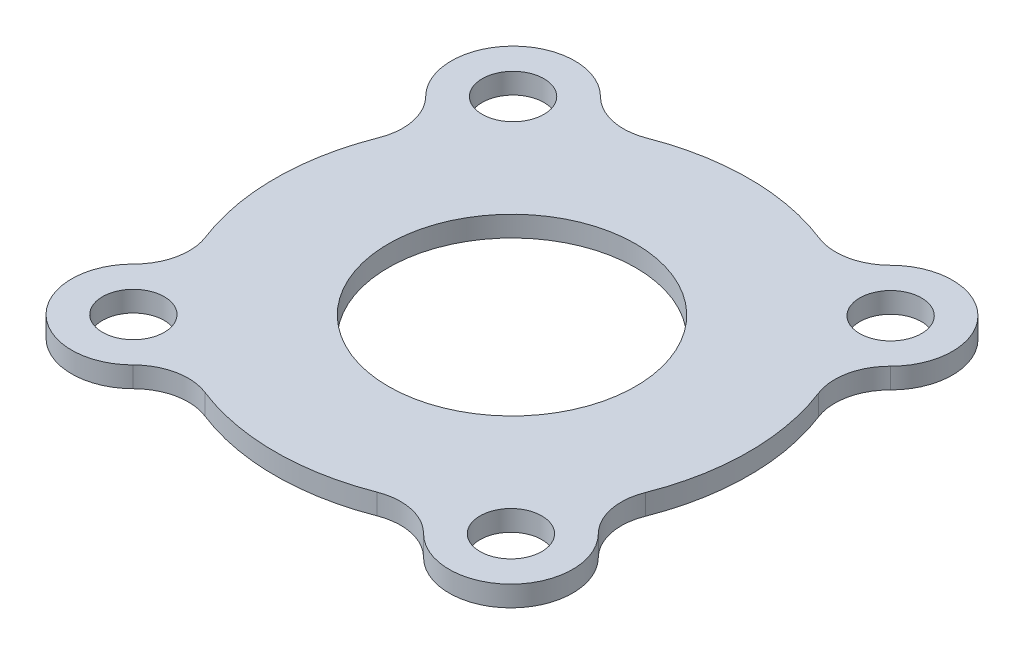
ISO-10303-21;
HEADER;
FILE_DESCRIPTION(('STEP AP214'),'2;1');
FILE_NAME('part.step','',(''),(''),'','','');
FILE_SCHEMA(('AUTOMOTIVE_DESIGN { 1 0 10303 214 1 1 1 1 }'));
ENDSEC;
DATA;
#1=APPLICATION_CONTEXT('core data for automotive mechanical design processes');
#2=APPLICATION_PROTOCOL_DEFINITION('international standard','automotive_design',2000,#1);
#3=PRODUCT_CONTEXT('',#1,'mechanical');
#4=PRODUCT('Part','Part','',(#3));
#5=PRODUCT_RELATED_PRODUCT_CATEGORY('part','',(#4));
#6=PRODUCT_DEFINITION_FORMATION('','',#4);
#7=PRODUCT_DEFINITION_CONTEXT('part definition',#1,'design');
#8=PRODUCT_DEFINITION('design','',#6,#7);
#9=PRODUCT_DEFINITION_SHAPE('','',#8);
#10=(LENGTH_UNIT() NAMED_UNIT(*) SI_UNIT(.MILLI.,.METRE.));
#11=(NAMED_UNIT(*) PLANE_ANGLE_UNIT() SI_UNIT($,.RADIAN.));
#12=(NAMED_UNIT(*) SI_UNIT($,.STERADIAN.) SOLID_ANGLE_UNIT());
#13=UNCERTAINTY_MEASURE_WITH_UNIT(LENGTH_MEASURE(1.E-05),#10,'distance_accuracy_value','');
#14=(GEOMETRIC_REPRESENTATION_CONTEXT(3) GLOBAL_UNCERTAINTY_ASSIGNED_CONTEXT((#13)) GLOBAL_UNIT_ASSIGNED_CONTEXT((#10,
#11,#12)) REPRESENTATION_CONTEXT('',''));
#15=CARTESIAN_POINT('',(0.,0.,0.));
#16=DIRECTION('',(0.,0.,1.));
#17=DIRECTION('',(1.,0.,0.));
#18=AXIS2_PLACEMENT_3D('',#15,#16,#17);
#19=CARTESIAN_POINT('',(0.,0.,0.));
#20=DIRECTION('',(0.,1.,0.));
#21=DIRECTION('',(0.,0.,1.));
#22=AXIS2_PLACEMENT_3D('',#19,#20,#21);
#23=PLANE('',#22);
#24=CARTESIAN_POINT('',(0.,0.,0.));
#25=DIRECTION('',(0.,1.,0.));
#26=DIRECTION('',(0.,0.,1.));
#27=AXIS2_PLACEMENT_3D('',#24,#25,#26);
#28=CIRCLE('',#27,6.00000000000002);
#29=CARTESIAN_POINT('',(0.,0.,6.00000000000002));
#30=VERTEX_POINT('',#29);
#31=EDGE_CURVE('E282',#30,#30,#28,.T.);
#32=ORIENTED_EDGE('',*,*,#31,.T.);
#33=EDGE_LOOP('',(#32));
#34=FACE_BOUND('',#33,.T.);
#35=CARTESIAN_POINT('',(0.,0.,0.));
#36=DIRECTION('',(0.,1.,0.));
#37=DIRECTION('',(0.,0.,1.));
#38=AXIS2_PLACEMENT_3D('',#35,#36,#37);
#39=CIRCLE('',#38,8.);
#40=CARTESIAN_POINT('',(0.,0.,8.));
#41=VERTEX_POINT('',#40);
#42=EDGE_CURVE('E11',#41,#41,#39,.T.);
#43=ORIENTED_EDGE('',*,*,#42,.F.);
#44=EDGE_LOOP('',(#43));
#45=FACE_BOUND('',#44,.T.);
#46=ADVANCED_FACE('F43',(#34,#45),#23,.F.);
#47=CARTESIAN_POINT('',(-9.21860010244733,1.,9.16610125141419));
#48=DIRECTION('',(0.,-1.,0.));
#49=DIRECTION('',(0.,0.,-1.));
#50=AXIS2_PLACEMENT_3D('',#47,#48,#49);
#51=CYLINDRICAL_SURFACE('',#50,2.99999999999999);
#52=CARTESIAN_POINT('',(-9.21860010244733,0.,9.16610125141419));
#53=DIRECTION('',(0.,1.,0.));
#54=DIRECTION('',(0.,0.,1.));
#55=AXIS2_PLACEMENT_3D('',#52,#53,#54);
#56=CIRCLE('',#55,2.99999999999999);
#57=CARTESIAN_POINT('',(-7.10334596750564,0.,11.2934705058243));
#58=VERTEX_POINT('',#57);
#59=CARTESIAN_POINT('',(-11.3338542373886,0.,7.03873199700244));
#60=VERTEX_POINT('',#59);
#61=EDGE_CURVE('E215',#58,#60,#56,.F.);
#62=ORIENTED_EDGE('',*,*,#61,.F.);
#63=DIRECTION('',(0.,-1.,0.));
#64=VECTOR('',#63,1.);
#65=CARTESIAN_POINT('',(-7.10334596750564,1.,11.2934705058243));
#66=LINE('',#65,#64);
#67=CARTESIAN_POINT('',(-7.10334596750564,1.,11.2934705058243));
#68=VERTEX_POINT('',#67);
#69=EDGE_CURVE('E53',#68,#58,#66,.T.);
#70=ORIENTED_EDGE('',*,*,#69,.F.);
#71=CARTESIAN_POINT('',(-9.21860010244733,1.,9.16610125141419));
#72=DIRECTION('',(0.,1.,0.));
#73=DIRECTION('',(0.,0.,1.));
#74=AXIS2_PLACEMENT_3D('',#71,#72,#73);
#75=CIRCLE('',#74,2.99999999999999);
#76=CARTESIAN_POINT('',(-11.3338542373886,1.,7.03873199700244));
#77=VERTEX_POINT('',#76);
#78=EDGE_CURVE('E286',#68,#77,#75,.F.);
#79=ORIENTED_EDGE('',*,*,#78,.T.);
#80=DIRECTION('',(0.,-1.,0.));
#81=VECTOR('',#80,1.);
#82=CARTESIAN_POINT('',(-11.3338542373886,1.,7.03873199700244));
#83=LINE('',#82,#81);
#84=EDGE_CURVE('E120',#77,#60,#83,.T.);
#85=ORIENTED_EDGE('',*,*,#84,.T.);
#86=EDGE_LOOP('',(#62,#70,#79,#85));
#87=FACE_BOUND('',#86,.T.);
#88=ADVANCED_FACE('F45',(#87),#51,.T.);
#89=CARTESIAN_POINT('',(-5.2058385817496,1.,13.2018458663984));
#90=DIRECTION('',(0.,-1.,0.));
#91=DIRECTION('',(0.,0.,-1.));
#92=AXIS2_PLACEMENT_3D('',#89,#90,#91);
#93=CYLINDRICAL_SURFACE('',#92,2.69117647058813);
#94=CARTESIAN_POINT('',(-5.2058385817496,0.,13.2018458663984));
#95=DIRECTION('',(0.,1.,0.));
#96=DIRECTION('',(0.,0.,1.));
#97=AXIS2_PLACEMENT_3D('',#94,#95,#96);
#98=CIRCLE('',#97,2.69117647058813);
#99=CARTESIAN_POINT('',(-4.21861737920023,0.,10.6982833860349));
#100=VERTEX_POINT('',#99);
#101=EDGE_CURVE('E219',#100,#58,#98,.T.);
#102=ORIENTED_EDGE('',*,*,#101,.F.);
#103=DIRECTION('',(0.,-1.,0.));
#104=VECTOR('',#103,1.);
#105=CARTESIAN_POINT('',(-4.21861737920023,1.,10.6982833860349));
#106=LINE('',#105,#104);
#107=CARTESIAN_POINT('',(-4.21861737920023,1.,10.6982833860349));
#108=VERTEX_POINT('',#107);
#109=EDGE_CURVE('E326',#108,#100,#106,.T.);
#110=ORIENTED_EDGE('',*,*,#109,.F.);
#111=CARTESIAN_POINT('',(-5.2058385817496,1.,13.2018458663984));
#112=DIRECTION('',(0.,1.,0.));
#113=DIRECTION('',(0.,0.,1.));
#114=AXIS2_PLACEMENT_3D('',#111,#112,#113);
#115=CIRCLE('',#114,2.69117647058813);
#116=EDGE_CURVE('E334',#108,#68,#115,.T.);
#117=ORIENTED_EDGE('',*,*,#116,.T.);
#118=ORIENTED_EDGE('',*,*,#69,.T.);
#119=EDGE_LOOP('',(#102,#110,#117,#118));
#120=FACE_BOUND('',#119,.T.);
#121=ADVANCED_FACE('F332',(#120),#93,.F.);
#122=CARTESIAN_POINT('',(0.,1.,0.));
#123=DIRECTION('',(0.,-1.,0.));
#124=DIRECTION('',(0.,0.,-1.));
#125=AXIS2_PLACEMENT_3D('',#122,#123,#124);
#126=CYLINDRICAL_SURFACE('',#125,11.5);
#127=CARTESIAN_POINT('',(0.,0.,0.));
#128=DIRECTION('',(0.,1.,0.));
#129=DIRECTION('',(0.,0.,1.));
#130=AXIS2_PLACEMENT_3D('',#127,#128,#129);
#131=CIRCLE('',#130,11.5);
#132=CARTESIAN_POINT('',(4.15744962661815,0.,10.7222018541964));
#133=VERTEX_POINT('',#132);
#134=EDGE_CURVE('E224',#100,#133,#131,.T.);
#135=ORIENTED_EDGE('',*,*,#134,.T.);
#136=DIRECTION('',(0.,-1.,0.));
#137=VECTOR('',#136,1.);
#138=CARTESIAN_POINT('',(4.15744962661815,1.,10.7222018541964));
#139=LINE('',#138,#137);
#140=CARTESIAN_POINT('',(4.15744962661815,1.,10.7222018541964));
#141=VERTEX_POINT('',#140);
#142=EDGE_CURVE('E322',#141,#133,#139,.T.);
#143=ORIENTED_EDGE('',*,*,#142,.F.);
#144=CARTESIAN_POINT('',(0.,1.,0.));
#145=DIRECTION('',(0.,1.,0.));
#146=DIRECTION('',(0.,0.,1.));
#147=AXIS2_PLACEMENT_3D('',#144,#145,#146);
#148=CIRCLE('',#147,11.5);
#149=EDGE_CURVE('E180',#108,#141,#148,.T.);
#150=ORIENTED_EDGE('',*,*,#149,.F.);
#151=ORIENTED_EDGE('',*,*,#109,.T.);
#152=EDGE_LOOP('',(#135,#143,#150,#151));
#153=FACE_BOUND('',#152,.T.);
#154=ADVANCED_FACE('F343',(#153),#126,.T.);
#155=CARTESIAN_POINT('',(5.13035663642772,1.,13.231361623145));
#156=DIRECTION('',(0.,-1.,0.));
#157=DIRECTION('',(0.,0.,-1.));
#158=AXIS2_PLACEMENT_3D('',#155,#156,#157);
#159=CYLINDRICAL_SURFACE('',#158,2.6911764705881);
#160=CARTESIAN_POINT('',(5.13035663642772,0.,13.231361623145));
#161=DIRECTION('',(0.,1.,0.));
#162=DIRECTION('',(0.,0.,1.));
#163=AXIS2_PLACEMENT_3D('',#160,#161,#162);
#164=CIRCLE('',#163,2.6911764705881);
#165=CARTESIAN_POINT('',(7.03873199700201,0.,11.333854237389));
#166=VERTEX_POINT('',#165);
#167=EDGE_CURVE('E227',#133,#166,#164,.F.);
#168=ORIENTED_EDGE('',*,*,#167,.T.);
#169=DIRECTION('',(0.,-1.,0.));
#170=VECTOR('',#169,1.);
#171=CARTESIAN_POINT('',(7.03873199700201,1.,11.333854237389));
#172=LINE('',#171,#170);
#173=CARTESIAN_POINT('',(7.03873199700201,1.,11.333854237389));
#174=VERTEX_POINT('',#173);
#175=EDGE_CURVE('E319',#174,#166,#172,.T.);
#176=ORIENTED_EDGE('',*,*,#175,.F.);
#177=CARTESIAN_POINT('',(5.13035663642772,1.,13.231361623145));
#178=DIRECTION('',(0.,1.,0.));
#179=DIRECTION('',(0.,0.,1.));
#180=AXIS2_PLACEMENT_3D('',#177,#178,#179);
#181=CIRCLE('',#180,2.6911764705881);
#182=EDGE_CURVE('E349',#141,#174,#181,.F.);
#183=ORIENTED_EDGE('',*,*,#182,.F.);
#184=ORIENTED_EDGE('',*,*,#142,.T.);
#185=EDGE_LOOP('',(#168,#176,#183,#184));
#186=FACE_BOUND('',#185,.T.);
#187=ADVANCED_FACE('F347',(#186),#159,.F.);
#188=CARTESIAN_POINT('',(9.16610125141293,1.,9.21860010244762));
#189=DIRECTION('',(0.,-1.,0.));
#190=DIRECTION('',(0.,0.,-1.));
#191=AXIS2_PLACEMENT_3D('',#188,#189,#190);
#192=CYLINDRICAL_SURFACE('',#191,3.00000000000001);
#193=CARTESIAN_POINT('',(9.16610125141293,0.,9.21860010244762));
#194=DIRECTION('',(0.,1.,0.));
#195=DIRECTION('',(0.,0.,1.));
#196=AXIS2_PLACEMENT_3D('',#193,#194,#195);
#197=CIRCLE('',#196,3.00000000000001);
#198=CARTESIAN_POINT('',(11.2934705058239,0.,7.10334596750601));
#199=VERTEX_POINT('',#198);
#200=EDGE_CURVE('E232',#199,#166,#197,.F.);
#201=ORIENTED_EDGE('',*,*,#200,.F.);
#202=DIRECTION('',(0.,-1.,0.));
#203=VECTOR('',#202,1.);
#204=CARTESIAN_POINT('',(11.2934705058239,1.,7.10334596750601));
#205=LINE('',#204,#203);
#206=CARTESIAN_POINT('',(11.2934705058239,1.,7.10334596750601));
#207=VERTEX_POINT('',#206);
#208=EDGE_CURVE('E316',#207,#199,#205,.T.);
#209=ORIENTED_EDGE('',*,*,#208,.F.);
#210=CARTESIAN_POINT('',(9.16610125141293,1.,9.21860010244762));
#211=DIRECTION('',(0.,1.,0.));
#212=DIRECTION('',(0.,0.,1.));
#213=AXIS2_PLACEMENT_3D('',#210,#211,#212);
#214=CIRCLE('',#213,3.00000000000001);
#215=EDGE_CURVE('E353',#207,#174,#214,.F.);
#216=ORIENTED_EDGE('',*,*,#215,.T.);
#217=ORIENTED_EDGE('',*,*,#175,.T.);
#218=EDGE_LOOP('',(#201,#209,#216,#217));
#219=FACE_BOUND('',#218,.T.);
#220=ADVANCED_FACE('F643',(#219),#192,.T.);
#221=CARTESIAN_POINT('',(13.2018458663984,1.,5.20583858174958));
#222=DIRECTION('',(0.,-1.,0.));
#223=DIRECTION('',(0.,0.,-1.));
#224=AXIS2_PLACEMENT_3D('',#221,#222,#223);
#225=CYLINDRICAL_SURFACE('',#224,2.69117647058808);
#226=CARTESIAN_POINT('',(13.2018458663984,0.,5.20583858174958));
#227=DIRECTION('',(0.,1.,0.));
#228=DIRECTION('',(0.,0.,1.));
#229=AXIS2_PLACEMENT_3D('',#226,#227,#228);
#230=CIRCLE('',#229,2.69117647058808);
#231=CARTESIAN_POINT('',(10.6982833860349,0.,4.21861737920022));
#232=VERTEX_POINT('',#231);
#233=EDGE_CURVE('E236',#232,#199,#230,.T.);
#234=ORIENTED_EDGE('',*,*,#233,.F.);
#235=DIRECTION('',(0.,-1.,0.));
#236=VECTOR('',#235,1.);
#237=CARTESIAN_POINT('',(10.6982833860349,1.,4.21861737920022));
#238=LINE('',#237,#236);
#239=CARTESIAN_POINT('',(10.6982833860349,1.,4.21861737920022));
#240=VERTEX_POINT('',#239);
#241=EDGE_CURVE('E313',#240,#232,#238,.T.);
#242=ORIENTED_EDGE('',*,*,#241,.F.);
#243=CARTESIAN_POINT('',(13.2018458663984,1.,5.20583858174958));
#244=DIRECTION('',(0.,1.,0.));
#245=DIRECTION('',(0.,0.,1.));
#246=AXIS2_PLACEMENT_3D('',#243,#244,#245);
#247=CIRCLE('',#246,2.69117647058808);
#248=EDGE_CURVE('E357',#240,#207,#247,.T.);
#249=ORIENTED_EDGE('',*,*,#248,.T.);
#250=ORIENTED_EDGE('',*,*,#208,.T.);
#251=EDGE_LOOP('',(#234,#242,#249,#250));
#252=FACE_BOUND('',#251,.T.);
#253=ADVANCED_FACE('F635',(#252),#225,.F.);
#254=CARTESIAN_POINT('',(10.7222018541964,0.,-4.15744962661816));
#255=VERTEX_POINT('',#254);
#256=EDGE_CURVE('E228',#232,#255,#131,.T.);
#257=ORIENTED_EDGE('',*,*,#256,.T.);
#258=DIRECTION('',(0.,-1.,0.));
#259=VECTOR('',#258,1.);
#260=CARTESIAN_POINT('',(10.7222018541964,1.,-4.15744962661816));
#261=LINE('',#260,#259);
#262=CARTESIAN_POINT('',(10.7222018541964,1.,-4.15744962661816));
#263=VERTEX_POINT('',#262);
#264=EDGE_CURVE('E309',#263,#255,#261,.T.);
#265=ORIENTED_EDGE('',*,*,#264,.F.);
#266=EDGE_CURVE('E359',#240,#263,#148,.T.);
#267=ORIENTED_EDGE('',*,*,#266,.F.);
#268=ORIENTED_EDGE('',*,*,#241,.T.);
#269=EDGE_LOOP('',(#257,#265,#267,#268));
#270=FACE_BOUND('',#269,.T.);
#271=ADVANCED_FACE('F390',(#270),#126,.T.);
#272=CARTESIAN_POINT('',(13.2313616231451,1.,-5.13035663642774));
#273=DIRECTION('',(0.,-1.,0.));
#274=DIRECTION('',(0.,0.,-1.));
#275=AXIS2_PLACEMENT_3D('',#272,#273,#274);
#276=CYLINDRICAL_SURFACE('',#275,2.69117647058813);
#277=CARTESIAN_POINT('',(13.2313616231451,0.,-5.13035663642774));
#278=DIRECTION('',(0.,1.,0.));
#279=DIRECTION('',(0.,0.,1.));
#280=AXIS2_PLACEMENT_3D('',#277,#278,#279);
#281=CIRCLE('',#280,2.69117647058813);
#282=CARTESIAN_POINT('',(11.3338542373887,0.,-7.03873199700238));
#283=VERTEX_POINT('',#282);
#284=EDGE_CURVE('E240',#255,#283,#281,.F.);
#285=ORIENTED_EDGE('',*,*,#284,.T.);
#286=DIRECTION('',(0.,-1.,0.));
#287=VECTOR('',#286,1.);
#288=CARTESIAN_POINT('',(11.3338542373887,1.,-7.03873199700238));
#289=LINE('',#288,#287);
#290=CARTESIAN_POINT('',(11.3338542373887,1.,-7.03873199700238));
#291=VERTEX_POINT('',#290);
#292=EDGE_CURVE('E306',#291,#283,#289,.T.);
#293=ORIENTED_EDGE('',*,*,#292,.F.);
#294=CARTESIAN_POINT('',(13.2313616231451,1.,-5.13035663642774));
#295=DIRECTION('',(0.,1.,0.));
#296=DIRECTION('',(0.,0.,1.));
#297=AXIS2_PLACEMENT_3D('',#294,#295,#296);
#298=CIRCLE('',#297,2.69117647058813);
#299=EDGE_CURVE('E365',#263,#291,#298,.F.);
#300=ORIENTED_EDGE('',*,*,#299,.F.);
#301=ORIENTED_EDGE('',*,*,#264,.T.);
#302=EDGE_LOOP('',(#285,#293,#300,#301));
#303=FACE_BOUND('',#302,.T.);
#304=ADVANCED_FACE('F394',(#303),#276,.F.);
#305=CARTESIAN_POINT('',(9.21860010244641,1.,-9.16610125141287));
#306=DIRECTION('',(0.,-1.,0.));
#307=DIRECTION('',(0.,0.,-1.));
#308=AXIS2_PLACEMENT_3D('',#305,#306,#307);
#309=CYLINDRICAL_SURFACE('',#308,2.99999999999998);
#310=CARTESIAN_POINT('',(9.21860010244641,0.,-9.16610125141287));
#311=DIRECTION('',(0.,1.,0.));
#312=DIRECTION('',(0.,0.,1.));
#313=AXIS2_PLACEMENT_3D('',#310,#311,#312);
#314=CIRCLE('',#313,2.99999999999998);
#315=CARTESIAN_POINT('',(7.1033459675057,0.,-11.2934705058242));
#316=VERTEX_POINT('',#315);
#317=EDGE_CURVE('E244',#316,#283,#314,.F.);
#318=ORIENTED_EDGE('',*,*,#317,.F.);
#319=DIRECTION('',(0.,-1.,0.));
#320=VECTOR('',#319,1.);
#321=CARTESIAN_POINT('',(7.1033459675057,1.,-11.2934705058242));
#322=LINE('',#321,#320);
#323=CARTESIAN_POINT('',(7.1033459675057,1.,-11.2934705058242));
#324=VERTEX_POINT('',#323);
#325=EDGE_CURVE('E303',#324,#316,#322,.T.);
#326=ORIENTED_EDGE('',*,*,#325,.F.);
#327=CARTESIAN_POINT('',(9.21860010244641,1.,-9.16610125141287));
#328=DIRECTION('',(0.,1.,0.));
#329=DIRECTION('',(0.,0.,1.));
#330=AXIS2_PLACEMENT_3D('',#327,#328,#329);
#331=CIRCLE('',#330,2.99999999999998);
#332=EDGE_CURVE('E368',#324,#291,#331,.F.);
#333=ORIENTED_EDGE('',*,*,#332,.T.);
#334=ORIENTED_EDGE('',*,*,#292,.T.);
#335=EDGE_LOOP('',(#318,#326,#333,#334));
#336=FACE_BOUND('',#335,.T.);
#337=ADVANCED_FACE('F397',(#336),#309,.T.);
#338=CARTESIAN_POINT('',(5.20583858174955,1.,-13.2018458663985));
#339=DIRECTION('',(0.,-1.,0.));
#340=DIRECTION('',(0.,0.,-1.));
#341=AXIS2_PLACEMENT_3D('',#338,#339,#340);
#342=CYLINDRICAL_SURFACE('',#341,2.69117647058813);
#343=CARTESIAN_POINT('',(5.20583858174955,0.,-13.2018458663985));
#344=DIRECTION('',(0.,1.,0.));
#345=DIRECTION('',(0.,0.,1.));
#346=AXIS2_PLACEMENT_3D('',#343,#344,#345);
#347=CIRCLE('',#346,2.69117647058813);
#348=CARTESIAN_POINT('',(4.21861737920019,0.,-10.6982833860349));
#349=VERTEX_POINT('',#348);
#350=EDGE_CURVE('E248',#349,#316,#347,.T.);
#351=ORIENTED_EDGE('',*,*,#350,.F.);
#352=DIRECTION('',(0.,-1.,0.));
#353=VECTOR('',#352,1.);
#354=CARTESIAN_POINT('',(4.21861737920019,1.,-10.6982833860349));
#355=LINE('',#354,#353);
#356=CARTESIAN_POINT('',(4.21861737920019,1.,-10.6982833860349));
#357=VERTEX_POINT('',#356);
#358=EDGE_CURVE('E300',#357,#349,#355,.T.);
#359=ORIENTED_EDGE('',*,*,#358,.F.);
#360=CARTESIAN_POINT('',(5.20583858174955,1.,-13.2018458663985));
#361=DIRECTION('',(0.,1.,0.));
#362=DIRECTION('',(0.,0.,1.));
#363=AXIS2_PLACEMENT_3D('',#360,#361,#362);
#364=CIRCLE('',#363,2.69117647058813);
#365=EDGE_CURVE('E372',#357,#324,#364,.T.);
#366=ORIENTED_EDGE('',*,*,#365,.T.);
#367=ORIENTED_EDGE('',*,*,#325,.T.);
#368=EDGE_LOOP('',(#351,#359,#366,#367));
#369=FACE_BOUND('',#368,.T.);
#370=ADVANCED_FACE('F400',(#369),#342,.F.);
#371=CARTESIAN_POINT('',(-4.15744962661817,0.,-10.7222018541964));
#372=VERTEX_POINT('',#371);
#373=EDGE_CURVE('E252',#349,#372,#131,.T.);
#374=ORIENTED_EDGE('',*,*,#373,.T.);
#375=DIRECTION('',(0.,-1.,0.));
#376=VECTOR('',#375,1.);
#377=CARTESIAN_POINT('',(-4.15744962661817,1.,-10.7222018541964));
#378=LINE('',#377,#376);
#379=CARTESIAN_POINT('',(-4.15744962661817,1.,-10.7222018541964));
#380=VERTEX_POINT('',#379);
#381=EDGE_CURVE('E296',#380,#372,#378,.T.);
#382=ORIENTED_EDGE('',*,*,#381,.F.);
#383=EDGE_CURVE('E179',#357,#380,#148,.T.);
#384=ORIENTED_EDGE('',*,*,#383,.F.);
#385=ORIENTED_EDGE('',*,*,#358,.T.);
#386=EDGE_LOOP('',(#374,#382,#384,#385));
#387=FACE_BOUND('',#386,.T.);
#388=ADVANCED_FACE('F403',(#387),#126,.T.);
#389=CARTESIAN_POINT('',(-5.13035663642775,1.,-13.2313616231451));
#390=DIRECTION('',(0.,-1.,0.));
#391=DIRECTION('',(0.,0.,-1.));
#392=AXIS2_PLACEMENT_3D('',#389,#390,#391);
#393=CYLINDRICAL_SURFACE('',#392,2.69117647058809);
#394=CARTESIAN_POINT('',(-5.13035663642775,0.,-13.2313616231451));
#395=DIRECTION('',(0.,1.,0.));
#396=DIRECTION('',(0.,0.,1.));
#397=AXIS2_PLACEMENT_3D('',#394,#395,#396);
#398=CIRCLE('',#397,2.69117647058809);
#399=CARTESIAN_POINT('',(-7.03873199700275,0.,-11.3338542373884));
#400=VERTEX_POINT('',#399);
#401=EDGE_CURVE('E253',#372,#400,#398,.F.);
#402=ORIENTED_EDGE('',*,*,#401,.T.);
#403=DIRECTION('',(0.,-1.,0.));
#404=VECTOR('',#403,1.);
#405=CARTESIAN_POINT('',(-7.03873199700275,1.,-11.3338542373884));
#406=LINE('',#405,#404);
#407=CARTESIAN_POINT('',(-7.03873199700275,1.,-11.3338542373884));
#408=VERTEX_POINT('',#407);
#409=EDGE_CURVE('E293',#408,#400,#406,.T.);
#410=ORIENTED_EDGE('',*,*,#409,.F.);
#411=CARTESIAN_POINT('',(-5.13035663642775,1.,-13.2313616231451));
#412=DIRECTION('',(0.,1.,0.));
#413=DIRECTION('',(0.,0.,1.));
#414=AXIS2_PLACEMENT_3D('',#411,#412,#413);
#415=CIRCLE('',#414,2.69117647058809);
#416=EDGE_CURVE('E189',#380,#408,#415,.F.);
#417=ORIENTED_EDGE('',*,*,#416,.F.);
#418=ORIENTED_EDGE('',*,*,#381,.T.);
#419=EDGE_LOOP('',(#402,#410,#417,#418));
#420=FACE_BOUND('',#419,.T.);
#421=ADVANCED_FACE('F406',(#420),#393,.F.);
#422=CARTESIAN_POINT('',(-9.16610125141404,1.,-9.21860010244624));
#423=DIRECTION('',(0.,-1.,0.));
#424=DIRECTION('',(0.,0.,-1.));
#425=AXIS2_PLACEMENT_3D('',#422,#423,#424);
#426=CYLINDRICAL_SURFACE('',#425,2.99999999999999);
#427=CARTESIAN_POINT('',(-9.16610125141404,0.,-9.21860010244624));
#428=DIRECTION('',(0.,1.,0.));
#429=DIRECTION('',(0.,0.,1.));
#430=AXIS2_PLACEMENT_3D('',#427,#428,#429);
#431=CIRCLE('',#430,2.99999999999999);
#432=CARTESIAN_POINT('',(-11.2934705058246,0.,-7.10334596750539));
#433=VERTEX_POINT('',#432);
#434=EDGE_CURVE('E257',#433,#400,#431,.F.);
#435=ORIENTED_EDGE('',*,*,#434,.F.);
#436=DIRECTION('',(0.,-1.,0.));
#437=VECTOR('',#436,1.);
#438=CARTESIAN_POINT('',(-11.2934705058246,1.,-7.10334596750539));
#439=LINE('',#438,#437);
#440=CARTESIAN_POINT('',(-11.2934705058246,1.,-7.10334596750539));
#441=VERTEX_POINT('',#440);
#442=EDGE_CURVE('E172',#441,#433,#439,.T.);
#443=ORIENTED_EDGE('',*,*,#442,.F.);
#444=CARTESIAN_POINT('',(-9.16610125141404,1.,-9.21860010244624));
#445=DIRECTION('',(0.,1.,0.));
#446=DIRECTION('',(0.,0.,1.));
#447=AXIS2_PLACEMENT_3D('',#444,#445,#446);
#448=CIRCLE('',#447,2.99999999999999);
#449=EDGE_CURVE('E185',#441,#408,#448,.F.);
#450=ORIENTED_EDGE('',*,*,#449,.T.);
#451=ORIENTED_EDGE('',*,*,#409,.T.);
#452=EDGE_LOOP('',(#435,#443,#450,#451));
#453=FACE_BOUND('',#452,.T.);
#454=ADVANCED_FACE('F409',(#453),#426,.T.);
#455=CARTESIAN_POINT('',(-13.2018458663985,1.,-5.20583858174958));
#456=DIRECTION('',(0.,-1.,0.));
#457=DIRECTION('',(0.,0.,-1.));
#458=AXIS2_PLACEMENT_3D('',#455,#456,#457);
#459=CYLINDRICAL_SURFACE('',#458,2.69117647058815);
#460=CARTESIAN_POINT('',(-13.2018458663985,0.,-5.20583858174958));
#461=DIRECTION('',(0.,1.,0.));
#462=DIRECTION('',(0.,0.,1.));
#463=AXIS2_PLACEMENT_3D('',#460,#461,#462);
#464=CIRCLE('',#463,2.69117647058815);
#465=CARTESIAN_POINT('',(-10.6982833860349,0.,-4.2186173792002));
#466=VERTEX_POINT('',#465);
#467=EDGE_CURVE('E170',#466,#433,#464,.T.);
#468=ORIENTED_EDGE('',*,*,#467,.F.);
#469=DIRECTION('',(0.,-1.,0.));
#470=VECTOR('',#469,1.);
#471=CARTESIAN_POINT('',(-10.6982833860349,1.,-4.2186173792002));
#472=LINE('',#471,#470);
#473=CARTESIAN_POINT('',(-10.6982833860349,1.,-4.2186173792002));
#474=VERTEX_POINT('',#473);
#475=EDGE_CURVE('E164',#474,#466,#472,.T.);
#476=ORIENTED_EDGE('',*,*,#475,.F.);
#477=CARTESIAN_POINT('',(-13.2018458663985,1.,-5.20583858174958));
#478=DIRECTION('',(0.,1.,0.));
#479=DIRECTION('',(0.,0.,1.));
#480=AXIS2_PLACEMENT_3D('',#477,#478,#479);
#481=CIRCLE('',#480,2.69117647058815);
#482=EDGE_CURVE('E168',#474,#441,#481,.T.);
#483=ORIENTED_EDGE('',*,*,#482,.T.);
#484=ORIENTED_EDGE('',*,*,#442,.T.);
#485=EDGE_LOOP('',(#468,#476,#483,#484));
#486=FACE_BOUND('',#485,.T.);
#487=ADVANCED_FACE('F166',(#486),#459,.F.);
#488=CARTESIAN_POINT('',(-10.7222018541964,0.,4.1574496266181));
#489=VERTEX_POINT('',#488);
#490=EDGE_CURVE('E113',#466,#489,#131,.T.);
#491=ORIENTED_EDGE('',*,*,#490,.T.);
#492=DIRECTION('',(0.,-1.,0.));
#493=VECTOR('',#492,1.);
#494=CARTESIAN_POINT('',(-10.7222018541964,1.,4.1574496266181));
#495=LINE('',#494,#493);
#496=CARTESIAN_POINT('',(-10.7222018541964,1.,4.1574496266181));
#497=VERTEX_POINT('',#496);
#498=EDGE_CURVE('E173',#497,#489,#495,.T.);
#499=ORIENTED_EDGE('',*,*,#498,.F.);
#500=EDGE_CURVE('E175',#474,#497,#148,.T.);
#501=ORIENTED_EDGE('',*,*,#500,.F.);
#502=ORIENTED_EDGE('',*,*,#475,.T.);
#503=EDGE_LOOP('',(#491,#499,#501,#502));
#504=FACE_BOUND('',#503,.T.);
#505=ADVANCED_FACE('F176',(#504),#126,.T.);
#506=CARTESIAN_POINT('',(9.16610125141293,1.,9.21860010244762));
#507=DIRECTION('',(0.,-1.,0.));
#508=DIRECTION('',(0.,0.,-1.));
#509=AXIS2_PLACEMENT_3D('',#506,#507,#508);
#510=CYLINDRICAL_SURFACE('',#509,1.49999999999982);
#511=CARTESIAN_POINT('',(9.16610125141293,1.,9.21860010244762));
#512=DIRECTION('',(0.,1.,0.));
#513=DIRECTION('',(0.,0.,1.));
#514=AXIS2_PLACEMENT_3D('',#511,#512,#513);
#515=CIRCLE('',#514,1.49999999999982);
#516=CARTESIAN_POINT('',(9.16610125141293,1.,10.7186001024474));
#517=VERTEX_POINT('',#516);
#518=EDGE_CURVE('E207',#517,#517,#515,.T.);
#519=ORIENTED_EDGE('',*,*,#518,.T.);
#520=EDGE_LOOP('',(#519));
#521=FACE_BOUND('',#520,.T.);
#522=CARTESIAN_POINT('',(9.16610125141293,0.,9.21860010244762));
#523=DIRECTION('',(0.,1.,0.));
#524=DIRECTION('',(0.,0.,1.));
#525=AXIS2_PLACEMENT_3D('',#522,#523,#524);
#526=CIRCLE('',#525,1.49999999999982);
#527=CARTESIAN_POINT('',(9.16610125141293,0.,10.7186001024474));
#528=VERTEX_POINT('',#527);
#529=EDGE_CURVE('E278',#528,#528,#526,.T.);
#530=ORIENTED_EDGE('',*,*,#529,.F.);
#531=EDGE_LOOP('',(#530));
#532=FACE_BOUND('',#531,.T.);
#533=ADVANCED_FACE('F553',(#521,#532),#510,.F.);
#534=CARTESIAN_POINT('',(-9.21860010244733,1.,9.16610125141419));
#535=DIRECTION('',(0.,-1.,0.));
#536=DIRECTION('',(0.,0.,-1.));
#537=AXIS2_PLACEMENT_3D('',#534,#535,#536);
#538=CYLINDRICAL_SURFACE('',#537,1.5);
#539=CARTESIAN_POINT('',(-9.21860010244733,1.,9.16610125141419));
#540=DIRECTION('',(0.,1.,0.));
#541=DIRECTION('',(0.,0.,1.));
#542=AXIS2_PLACEMENT_3D('',#539,#540,#541);
#543=CIRCLE('',#542,1.5);
#544=CARTESIAN_POINT('',(-9.21860010244733,1.,10.6661012514142));
#545=VERTEX_POINT('',#544);
#546=EDGE_CURVE('E203',#545,#545,#543,.T.);
#547=ORIENTED_EDGE('',*,*,#546,.T.);
#548=EDGE_LOOP('',(#547));
#549=FACE_BOUND('',#548,.T.);
#550=CARTESIAN_POINT('',(-9.21860010244733,0.,9.16610125141419));
#551=DIRECTION('',(0.,1.,0.));
#552=DIRECTION('',(0.,0.,1.));
#553=AXIS2_PLACEMENT_3D('',#550,#551,#552);
#554=CIRCLE('',#553,1.5);
#555=CARTESIAN_POINT('',(-9.21860010244733,0.,10.6661012514142));
#556=VERTEX_POINT('',#555);
#557=EDGE_CURVE('E274',#556,#556,#554,.T.);
#558=ORIENTED_EDGE('',*,*,#557,.F.);
#559=EDGE_LOOP('',(#558));
#560=FACE_BOUND('',#559,.T.);
#561=ADVANCED_FACE('F543',(#549,#560),#538,.F.);
#562=CARTESIAN_POINT('',(-9.16610125141404,1.,-9.21860010244624));
#563=DIRECTION('',(0.,-1.,0.));
#564=DIRECTION('',(0.,0.,-1.));
#565=AXIS2_PLACEMENT_3D('',#562,#563,#564);
#566=CYLINDRICAL_SURFACE('',#565,1.50000000000002);
#567=CARTESIAN_POINT('',(-9.16610125141404,1.,-9.21860010244624));
#568=DIRECTION('',(0.,1.,0.));
#569=DIRECTION('',(0.,0.,1.));
#570=AXIS2_PLACEMENT_3D('',#567,#568,#569);
#571=CIRCLE('',#570,1.50000000000002);
#572=CARTESIAN_POINT('',(-9.16610125141404,1.,-7.71860010244622));
#573=VERTEX_POINT('',#572);
#574=EDGE_CURVE('E199',#573,#573,#571,.T.);
#575=ORIENTED_EDGE('',*,*,#574,.T.);
#576=EDGE_LOOP('',(#575));
#577=FACE_BOUND('',#576,.T.);
#578=CARTESIAN_POINT('',(-9.16610125141404,0.,-9.21860010244624));
#579=DIRECTION('',(0.,1.,0.));
#580=DIRECTION('',(0.,0.,1.));
#581=AXIS2_PLACEMENT_3D('',#578,#579,#580);
#582=CIRCLE('',#581,1.50000000000002);
#583=CARTESIAN_POINT('',(-9.16610125141404,0.,-7.71860010244622));
#584=VERTEX_POINT('',#583);
#585=EDGE_CURVE('E270',#584,#584,#582,.T.);
#586=ORIENTED_EDGE('',*,*,#585,.F.);
#587=EDGE_LOOP('',(#586));
#588=FACE_BOUND('',#587,.T.);
#589=ADVANCED_FACE('F533',(#577,#588),#566,.F.);
#590=CARTESIAN_POINT('',(9.21860010244641,1.,-9.16610125141287));
#591=DIRECTION('',(0.,-1.,0.));
#592=DIRECTION('',(0.,0.,-1.));
#593=AXIS2_PLACEMENT_3D('',#590,#591,#592);
#594=CYLINDRICAL_SURFACE('',#593,1.49999999999999);
#595=CARTESIAN_POINT('',(9.21860010244641,1.,-9.16610125141287));
#596=DIRECTION('',(0.,1.,0.));
#597=DIRECTION('',(0.,0.,1.));
#598=AXIS2_PLACEMENT_3D('',#595,#596,#597);
#599=CIRCLE('',#598,1.49999999999999);
#600=CARTESIAN_POINT('',(9.21860010244641,1.,-7.66610125141288));
#601=VERTEX_POINT('',#600);
#602=EDGE_CURVE('E195',#601,#601,#599,.T.);
#603=ORIENTED_EDGE('',*,*,#602,.T.);
#604=EDGE_LOOP('',(#603));
#605=FACE_BOUND('',#604,.T.);
#606=CARTESIAN_POINT('',(9.21860010244641,0.,-9.16610125141287));
#607=DIRECTION('',(0.,1.,0.));
#608=DIRECTION('',(0.,0.,1.));
#609=AXIS2_PLACEMENT_3D('',#606,#607,#608);
#610=CIRCLE('',#609,1.49999999999999);
#611=CARTESIAN_POINT('',(9.21860010244641,0.,-7.66610125141288));
#612=VERTEX_POINT('',#611);
#613=EDGE_CURVE('E266',#612,#612,#610,.T.);
#614=ORIENTED_EDGE('',*,*,#613,.F.);
#615=EDGE_LOOP('',(#614));
#616=FACE_BOUND('',#615,.T.);
#617=ADVANCED_FACE('F523',(#605,#616),#594,.F.);
#618=CARTESIAN_POINT('',(-13.2313616231452,1.,5.13035663642768));
#619=DIRECTION('',(0.,-1.,0.));
#620=DIRECTION('',(0.,0.,-1.));
#621=AXIS2_PLACEMENT_3D('',#618,#619,#620);
#622=CYLINDRICAL_SURFACE('',#621,2.69117647058815);
#623=CARTESIAN_POINT('',(-13.2313616231452,0.,5.13035663642768));
#624=DIRECTION('',(0.,1.,0.));
#625=DIRECTION('',(0.,0.,1.));
#626=AXIS2_PLACEMENT_3D('',#623,#624,#625);
#627=CIRCLE('',#626,2.69117647058815);
#628=EDGE_CURVE('E263',#489,#60,#627,.F.);
#629=ORIENTED_EDGE('',*,*,#628,.T.);
#630=ORIENTED_EDGE('',*,*,#84,.F.);
#631=CARTESIAN_POINT('',(-13.2313616231452,1.,5.13035663642768));
#632=DIRECTION('',(0.,1.,0.));
#633=DIRECTION('',(0.,0.,1.));
#634=AXIS2_PLACEMENT_3D('',#631,#632,#633);
#635=CIRCLE('',#634,2.69117647058815);
#636=EDGE_CURVE('E61',#497,#77,#635,.F.);
#637=ORIENTED_EDGE('',*,*,#636,.F.);
#638=ORIENTED_EDGE('',*,*,#498,.T.);
#639=EDGE_LOOP('',(#629,#630,#637,#638));
#640=FACE_BOUND('',#639,.T.);
#641=ADVANCED_FACE('F461',(#640),#622,.F.);
#642=CARTESIAN_POINT('',(0.,1.,0.));
#643=DIRECTION('',(0.,-1.,0.));
#644=DIRECTION('',(0.,0.,-1.));
#645=AXIS2_PLACEMENT_3D('',#642,#643,#644);
#646=CYLINDRICAL_SURFACE('',#645,6.00000000000002);
#647=CARTESIAN_POINT('',(0.,1.,0.));
#648=DIRECTION('',(0.,1.,0.));
#649=DIRECTION('',(0.,0.,1.));
#650=AXIS2_PLACEMENT_3D('',#647,#648,#649);
#651=CIRCLE('',#650,6.00000000000002);
#652=CARTESIAN_POINT('',(0.,1.,6.00000000000002));
#653=VERTEX_POINT('',#652);
#654=EDGE_CURVE('E211',#653,#653,#651,.T.);
#655=ORIENTED_EDGE('',*,*,#654,.T.);
#656=EDGE_LOOP('',(#655));
#657=FACE_BOUND('',#656,.T.);
#658=ORIENTED_EDGE('',*,*,#31,.F.);
#659=EDGE_LOOP('',(#658));
#660=FACE_BOUND('',#659,.T.);
#661=ADVANCED_FACE('F455',(#657,#660),#646,.F.);
#662=CARTESIAN_POINT('',(0.,1.,0.));
#663=DIRECTION('',(0.,1.,0.));
#664=DIRECTION('',(0.,0.,1.));
#665=AXIS2_PLACEMENT_3D('',#662,#663,#664);
#666=PLANE('',#665);
#667=ORIENTED_EDGE('',*,*,#78,.F.);
#668=ORIENTED_EDGE('',*,*,#116,.F.);
#669=ORIENTED_EDGE('',*,*,#149,.T.);
#670=ORIENTED_EDGE('',*,*,#182,.T.);
#671=ORIENTED_EDGE('',*,*,#215,.F.);
#672=ORIENTED_EDGE('',*,*,#248,.F.);
#673=ORIENTED_EDGE('',*,*,#266,.T.);
#674=ORIENTED_EDGE('',*,*,#299,.T.);
#675=ORIENTED_EDGE('',*,*,#332,.F.);
#676=ORIENTED_EDGE('',*,*,#365,.F.);
#677=ORIENTED_EDGE('',*,*,#383,.T.);
#678=ORIENTED_EDGE('',*,*,#416,.T.);
#679=ORIENTED_EDGE('',*,*,#449,.F.);
#680=ORIENTED_EDGE('',*,*,#482,.F.);
#681=ORIENTED_EDGE('',*,*,#500,.T.);
#682=ORIENTED_EDGE('',*,*,#636,.T.);
#683=EDGE_LOOP('',(#667,#668,#669,#670,#671,#672,#673,#674,#675,#676,#677,#678,#679,#680,#681,#682));
#684=FACE_BOUND('',#683,.T.);
#685=ORIENTED_EDGE('',*,*,#602,.F.);
#686=EDGE_LOOP('',(#685));
#687=FACE_BOUND('',#686,.T.);
#688=ORIENTED_EDGE('',*,*,#574,.F.);
#689=EDGE_LOOP('',(#688));
#690=FACE_BOUND('',#689,.T.);
#691=ORIENTED_EDGE('',*,*,#546,.F.);
#692=EDGE_LOOP('',(#691));
#693=FACE_BOUND('',#692,.T.);
#694=ORIENTED_EDGE('',*,*,#518,.F.);
#695=EDGE_LOOP('',(#694));
#696=FACE_BOUND('',#695,.T.);
#697=ORIENTED_EDGE('',*,*,#654,.F.);
#698=EDGE_LOOP('',(#697));
#699=FACE_BOUND('',#698,.T.);
#700=ADVANCED_FACE('F182',(#684,#687,#690,#693,#696,#699),#666,.T.);
#701=CARTESIAN_POINT('',(0.,0.,0.));
#702=DIRECTION('',(0.,1.,0.));
#703=DIRECTION('',(0.,0.,1.));
#704=AXIS2_PLACEMENT_3D('',#701,#702,#703);
#705=CIRCLE('',#704,9.5);
#706=CARTESIAN_POINT('',(0.,0.,9.5));
#707=VERTEX_POINT('',#706);
#708=EDGE_CURVE('E416',#707,#707,#705,.T.);
#709=ORIENTED_EDGE('',*,*,#708,.T.);
#710=EDGE_LOOP('',(#709));
#711=FACE_BOUND('',#710,.T.);
#712=ORIENTED_EDGE('',*,*,#61,.T.);
#713=ORIENTED_EDGE('',*,*,#628,.F.);
#714=ORIENTED_EDGE('',*,*,#490,.F.);
#715=ORIENTED_EDGE('',*,*,#467,.T.);
#716=ORIENTED_EDGE('',*,*,#434,.T.);
#717=ORIENTED_EDGE('',*,*,#401,.F.);
#718=ORIENTED_EDGE('',*,*,#373,.F.);
#719=ORIENTED_EDGE('',*,*,#350,.T.);
#720=ORIENTED_EDGE('',*,*,#317,.T.);
#721=ORIENTED_EDGE('',*,*,#284,.F.);
#722=ORIENTED_EDGE('',*,*,#256,.F.);
#723=ORIENTED_EDGE('',*,*,#233,.T.);
#724=ORIENTED_EDGE('',*,*,#200,.T.);
#725=ORIENTED_EDGE('',*,*,#167,.F.);
#726=ORIENTED_EDGE('',*,*,#134,.F.);
#727=ORIENTED_EDGE('',*,*,#101,.T.);
#728=EDGE_LOOP('',(#712,#713,#714,#715,#716,#717,#718,#719,#720,#721,#722,#723,#724,#725,#726,#727));
#729=FACE_BOUND('',#728,.T.);
#730=ORIENTED_EDGE('',*,*,#613,.T.);
#731=EDGE_LOOP('',(#730));
#732=FACE_BOUND('',#731,.T.);
#733=ORIENTED_EDGE('',*,*,#585,.T.);
#734=EDGE_LOOP('',(#733));
#735=FACE_BOUND('',#734,.T.);
#736=ORIENTED_EDGE('',*,*,#557,.T.);
#737=EDGE_LOOP('',(#736));
#738=FACE_BOUND('',#737,.T.);
#739=ORIENTED_EDGE('',*,*,#529,.T.);
#740=EDGE_LOOP('',(#739));
#741=FACE_BOUND('',#740,.T.);
#742=ADVANCED_FACE('F338',(#711,#729,#732,#735,#738,#741),#23,.F.);
#743=CARTESIAN_POINT('',(0.,-1.,0.));
#744=DIRECTION('',(0.,1.,0.));
#745=DIRECTION('',(0.,0.,1.));
#746=AXIS2_PLACEMENT_3D('',#743,#744,#745);
#747=CYLINDRICAL_SURFACE('',#746,9.5);
#748=CARTESIAN_POINT('',(0.,-1.,0.));
#749=DIRECTION('',(0.,1.,0.));
#750=DIRECTION('',(0.,0.,1.));
#751=AXIS2_PLACEMENT_3D('',#748,#749,#750);
#752=CIRCLE('',#751,9.5);
#753=CARTESIAN_POINT('',(0.,-1.,9.5));
#754=VERTEX_POINT('',#753);
#755=EDGE_CURVE('E220',#754,#754,#752,.T.);
#756=ORIENTED_EDGE('',*,*,#755,.T.);
#757=EDGE_LOOP('',(#756));
#758=FACE_BOUND('',#757,.T.);
#759=ORIENTED_EDGE('',*,*,#708,.F.);
#760=EDGE_LOOP('',(#759));
#761=FACE_BOUND('',#760,.T.);
#762=ADVANCED_FACE('F447',(#758,#761),#747,.T.);
#763=CARTESIAN_POINT('',(0.,-1.,0.));
#764=DIRECTION('',(0.,1.,0.));
#765=DIRECTION('',(0.,0.,1.));
#766=AXIS2_PLACEMENT_3D('',#763,#764,#765);
#767=PLANE('',#766);
#768=CARTESIAN_POINT('',(0.,-1.,0.));
#769=DIRECTION('',(0.,1.,0.));
#770=DIRECTION('',(0.,0.,1.));
#771=AXIS2_PLACEMENT_3D('',#768,#769,#770);
#772=CIRCLE('',#771,8.);
#773=CARTESIAN_POINT('',(0.,-1.,8.));
#774=VERTEX_POINT('',#773);
#775=EDGE_CURVE('E420',#774,#774,#772,.T.);
#776=ORIENTED_EDGE('',*,*,#775,.T.);
#777=EDGE_LOOP('',(#776));
#778=FACE_BOUND('',#777,.T.);
#779=ORIENTED_EDGE('',*,*,#755,.F.);
#780=EDGE_LOOP('',(#779));
#781=FACE_BOUND('',#780,.T.);
#782=ADVANCED_FACE('F429',(#778,#781),#767,.F.);
#783=CARTESIAN_POINT('',(0.,-1.,0.));
#784=DIRECTION('',(0.,1.,0.));
#785=DIRECTION('',(0.,0.,1.));
#786=AXIS2_PLACEMENT_3D('',#783,#784,#785);
#787=CYLINDRICAL_SURFACE('',#786,8.);
#788=ORIENTED_EDGE('',*,*,#775,.F.);
#789=EDGE_LOOP('',(#788));
#790=FACE_BOUND('',#789,.T.);
#791=ORIENTED_EDGE('',*,*,#42,.T.);
#792=EDGE_LOOP('',(#791));
#793=FACE_BOUND('',#792,.T.);
#794=ADVANCED_FACE('F432',(#790,#793),#787,.F.);
#795=CLOSED_SHELL('',(#46,#88,#121,#154,#187,#220,#253,#271,#304,#337,#370,#388,#421,#454,#487,
#505,#533,#561,#589,#617,#641,#661,#700,#742,#762,#782,#794));
#796=MANIFOLD_SOLID_BREP('B2',#795);
#797=ADVANCED_BREP_SHAPE_REPRESENTATION('',(#18,#796),#14);
#798=SHAPE_DEFINITION_REPRESENTATION(#9,#797);
ENDSEC;
END-ISO-10303-21;
